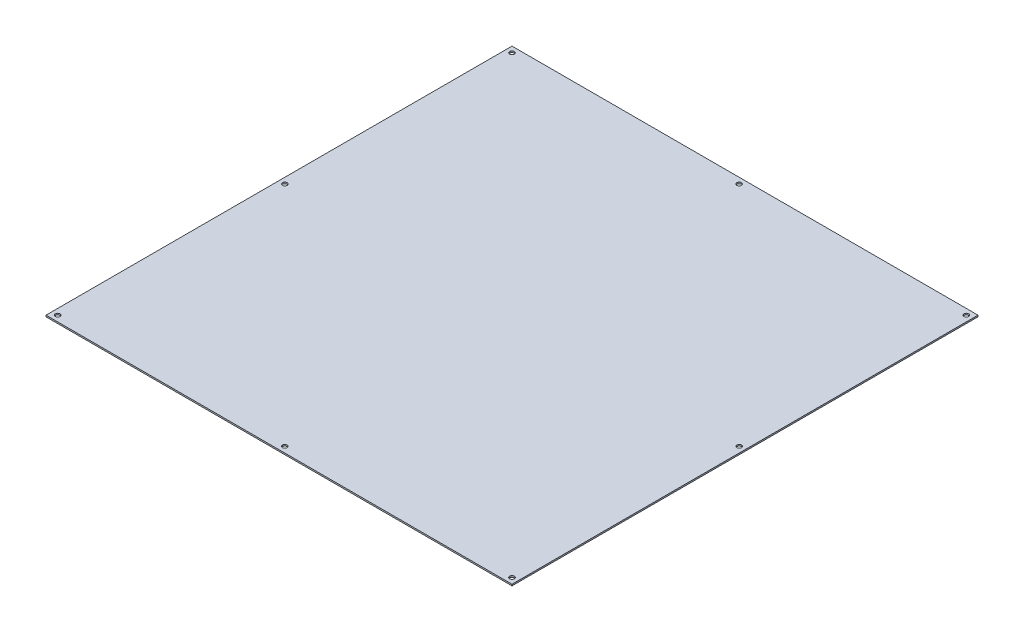
ISO-10303-21;
HEADER;
FILE_DESCRIPTION(('STEP AP214'),'2;1');
FILE_NAME('part.step','',(''),(''),'','','');
FILE_SCHEMA(('AUTOMOTIVE_DESIGN { 1 0 10303 214 1 1 1 1 }'));
ENDSEC;
DATA;
#1=APPLICATION_CONTEXT('core data for automotive mechanical design processes');
#2=APPLICATION_PROTOCOL_DEFINITION('international standard','automotive_design',2000,#1);
#3=PRODUCT_CONTEXT('',#1,'mechanical');
#4=PRODUCT('Part','Part','',(#3));
#5=PRODUCT_RELATED_PRODUCT_CATEGORY('part','',(#4));
#6=PRODUCT_DEFINITION_FORMATION('','',#4);
#7=PRODUCT_DEFINITION_CONTEXT('part definition',#1,'design');
#8=PRODUCT_DEFINITION('design','',#6,#7);
#9=PRODUCT_DEFINITION_SHAPE('','',#8);
#10=(LENGTH_UNIT() NAMED_UNIT(*) SI_UNIT(.MILLI.,.METRE.));
#11=(NAMED_UNIT(*) PLANE_ANGLE_UNIT() SI_UNIT($,.RADIAN.));
#12=(NAMED_UNIT(*) SI_UNIT($,.STERADIAN.) SOLID_ANGLE_UNIT());
#13=UNCERTAINTY_MEASURE_WITH_UNIT(LENGTH_MEASURE(1.E-05),#10,'distance_accuracy_value','');
#14=(GEOMETRIC_REPRESENTATION_CONTEXT(3) GLOBAL_UNCERTAINTY_ASSIGNED_CONTEXT((#13)) GLOBAL_UNIT_ASSIGNED_CONTEXT((#10,
#11,#12)) REPRESENTATION_CONTEXT('',''));
#15=CARTESIAN_POINT('',(0.,0.,0.));
#16=DIRECTION('',(0.,0.,1.));
#17=DIRECTION('',(1.,0.,0.));
#18=AXIS2_PLACEMENT_3D('',#15,#16,#17);
#19=CARTESIAN_POINT('',(160.,1.016,-160.));
#20=DIRECTION('',(-1.,0.,0.));
#21=DIRECTION('',(0.,0.,1.));
#22=AXIS2_PLACEMENT_3D('',#19,#20,#21);
#23=PLANE('',#22);
#24=DIRECTION('',(0.,0.,-1.));
#25=VECTOR('',#24,1.);
#26=CARTESIAN_POINT('',(160.,0.,-160.));
#27=LINE('',#26,#25);
#28=CARTESIAN_POINT('',(160.,0.,160.));
#29=VERTEX_POINT('',#28);
#30=CARTESIAN_POINT('',(160.,0.,-160.));
#31=VERTEX_POINT('',#30);
#32=EDGE_CURVE('E111',#29,#31,#27,.T.);
#33=ORIENTED_EDGE('',*,*,#32,.T.);
#34=DIRECTION('',(0.,-1.,0.));
#35=VECTOR('',#34,1.);
#36=CARTESIAN_POINT('',(160.,1.016,-160.));
#37=LINE('',#36,#35);
#38=CARTESIAN_POINT('',(160.,1.016,-160.));
#39=VERTEX_POINT('',#38);
#40=EDGE_CURVE('E11',#39,#31,#37,.T.);
#41=ORIENTED_EDGE('',*,*,#40,.F.);
#42=DIRECTION('',(0.,0.,-1.));
#43=VECTOR('',#42,1.);
#44=CARTESIAN_POINT('',(160.,1.016,-160.));
#45=LINE('',#44,#43);
#46=CARTESIAN_POINT('',(160.,1.016,160.));
#47=VERTEX_POINT('',#46);
#48=EDGE_CURVE('E95',#47,#39,#45,.T.);
#49=ORIENTED_EDGE('',*,*,#48,.F.);
#50=DIRECTION('',(0.,-1.,0.));
#51=VECTOR('',#50,1.);
#52=CARTESIAN_POINT('',(160.,1.016,160.));
#53=LINE('',#52,#51);
#54=EDGE_CURVE('E107',#47,#29,#53,.T.);
#55=ORIENTED_EDGE('',*,*,#54,.T.);
#56=EDGE_LOOP('',(#33,#41,#49,#55));
#57=FACE_BOUND('',#56,.T.);
#58=ADVANCED_FACE('F43',(#57),#23,.F.);
#59=CARTESIAN_POINT('',(-160.,1.016,-160.));
#60=DIRECTION('',(0.,0.,1.));
#61=DIRECTION('',(1.,0.,0.));
#62=AXIS2_PLACEMENT_3D('',#59,#60,#61);
#63=PLANE('',#62);
#64=DIRECTION('',(-1.,0.,0.));
#65=VECTOR('',#64,1.);
#66=CARTESIAN_POINT('',(-160.,0.,-160.));
#67=LINE('',#66,#65);
#68=CARTESIAN_POINT('',(-160.,0.,-160.));
#69=VERTEX_POINT('',#68);
#70=EDGE_CURVE('E100',#31,#69,#67,.T.);
#71=ORIENTED_EDGE('',*,*,#70,.T.);
#72=DIRECTION('',(0.,-1.,0.));
#73=VECTOR('',#72,1.);
#74=CARTESIAN_POINT('',(-160.,1.016,-160.));
#75=LINE('',#74,#73);
#76=CARTESIAN_POINT('',(-160.,1.016,-160.));
#77=VERTEX_POINT('',#76);
#78=EDGE_CURVE('E52',#77,#69,#75,.T.);
#79=ORIENTED_EDGE('',*,*,#78,.F.);
#80=DIRECTION('',(-1.,0.,0.));
#81=VECTOR('',#80,1.);
#82=CARTESIAN_POINT('',(-160.,1.016,-160.));
#83=LINE('',#82,#81);
#84=EDGE_CURVE('E90',#39,#77,#83,.T.);
#85=ORIENTED_EDGE('',*,*,#84,.F.);
#86=ORIENTED_EDGE('',*,*,#40,.T.);
#87=EDGE_LOOP('',(#71,#79,#85,#86));
#88=FACE_BOUND('',#87,.T.);
#89=ADVANCED_FACE('F99',(#88),#63,.F.);
#90=CARTESIAN_POINT('',(-160.,1.016,-160.));
#91=DIRECTION('',(1.,0.,0.));
#92=DIRECTION('',(0.,0.,-1.));
#93=AXIS2_PLACEMENT_3D('',#90,#91,#92);
#94=PLANE('',#93);
#95=DIRECTION('',(0.,0.,1.));
#96=VECTOR('',#95,1.);
#97=CARTESIAN_POINT('',(-160.,0.,-160.));
#98=LINE('',#97,#96);
#99=CARTESIAN_POINT('',(-160.,0.,160.));
#100=VERTEX_POINT('',#99);
#101=EDGE_CURVE('E77',#69,#100,#98,.T.);
#102=ORIENTED_EDGE('',*,*,#101,.T.);
#103=DIRECTION('',(0.,-1.,0.));
#104=VECTOR('',#103,1.);
#105=CARTESIAN_POINT('',(-160.,1.016,160.));
#106=LINE('',#105,#104);
#107=CARTESIAN_POINT('',(-160.,1.016,160.));
#108=VERTEX_POINT('',#107);
#109=EDGE_CURVE('E102',#108,#100,#106,.T.);
#110=ORIENTED_EDGE('',*,*,#109,.F.);
#111=DIRECTION('',(0.,0.,1.));
#112=VECTOR('',#111,1.);
#113=CARTESIAN_POINT('',(-160.,1.016,-160.));
#114=LINE('',#113,#112);
#115=EDGE_CURVE('E93',#77,#108,#114,.T.);
#116=ORIENTED_EDGE('',*,*,#115,.F.);
#117=ORIENTED_EDGE('',*,*,#78,.T.);
#118=EDGE_LOOP('',(#102,#110,#116,#117));
#119=FACE_BOUND('',#118,.T.);
#120=ADVANCED_FACE('F103',(#119),#94,.F.);
#121=CARTESIAN_POINT('',(-160.,1.016,160.));
#122=DIRECTION('',(0.,0.,-1.));
#123=DIRECTION('',(-1.,0.,0.));
#124=AXIS2_PLACEMENT_3D('',#121,#122,#123);
#125=PLANE('',#124);
#126=DIRECTION('',(1.,0.,0.));
#127=VECTOR('',#126,1.);
#128=CARTESIAN_POINT('',(-160.,0.,160.));
#129=LINE('',#128,#127);
#130=EDGE_CURVE('E83',#100,#29,#129,.T.);
#131=ORIENTED_EDGE('',*,*,#130,.T.);
#132=ORIENTED_EDGE('',*,*,#54,.F.);
#133=DIRECTION('',(1.,0.,0.));
#134=VECTOR('',#133,1.);
#135=CARTESIAN_POINT('',(-160.,1.016,160.));
#136=LINE('',#135,#134);
#137=EDGE_CURVE('E60',#108,#47,#136,.T.);
#138=ORIENTED_EDGE('',*,*,#137,.F.);
#139=ORIENTED_EDGE('',*,*,#109,.T.);
#140=EDGE_LOOP('',(#131,#132,#138,#139));
#141=FACE_BOUND('',#140,.T.);
#142=ADVANCED_FACE('F125',(#141),#125,.F.);
#143=CARTESIAN_POINT('',(0.,1.016,0.));
#144=DIRECTION('',(0.,1.,0.));
#145=DIRECTION('',(0.,0.,1.));
#146=AXIS2_PLACEMENT_3D('',#143,#144,#145);
#147=PLANE('',#146);
#148=CARTESIAN_POINT('',(-155.999999999997,1.016,156.));
#149=DIRECTION('',(0.,1.,0.));
#150=DIRECTION('',(0.,0.,1.));
#151=AXIS2_PLACEMENT_3D('',#148,#149,#150);
#152=CIRCLE('',#151,1.59999999999996);
#153=CARTESIAN_POINT('',(-155.999999999997,1.016,157.6));
#154=VERTEX_POINT('',#153);
#155=EDGE_CURVE('E160',#154,#154,#152,.T.);
#156=ORIENTED_EDGE('',*,*,#155,.F.);
#157=EDGE_LOOP('',(#156));
#158=FACE_BOUND('',#157,.T.);
#159=CARTESIAN_POINT('',(156.000000000002,1.016,0.));
#160=DIRECTION('',(0.,1.,0.));
#161=DIRECTION('',(0.,0.,-1.));
#162=AXIS2_PLACEMENT_3D('',#159,#160,#161);
#163=CIRCLE('',#162,1.59999999999996);
#164=CARTESIAN_POINT('',(156.000000000002,1.016,-1.59999999999996));
#165=VERTEX_POINT('',#164);
#166=EDGE_CURVE('E145',#165,#165,#163,.T.);
#167=ORIENTED_EDGE('',*,*,#166,.F.);
#168=EDGE_LOOP('',(#167));
#169=FACE_BOUND('',#168,.T.);
#170=CARTESIAN_POINT('',(-155.999999999998,1.016,0.));
#171=DIRECTION('',(0.,1.,0.));
#172=DIRECTION('',(0.,0.,1.));
#173=AXIS2_PLACEMENT_3D('',#170,#171,#172);
#174=CIRCLE('',#173,1.59999999999996);
#175=CARTESIAN_POINT('',(-155.999999999998,1.016,1.60000000000002));
#176=VERTEX_POINT('',#175);
#177=EDGE_CURVE('E144',#176,#176,#174,.T.);
#178=ORIENTED_EDGE('',*,*,#177,.F.);
#179=EDGE_LOOP('',(#178));
#180=FACE_BOUND('',#179,.T.);
#181=CARTESIAN_POINT('',(156.,1.016,-156.));
#182=DIRECTION('',(0.,1.,0.));
#183=DIRECTION('',(0.,0.,-1.));
#184=AXIS2_PLACEMENT_3D('',#181,#182,#183);
#185=CIRCLE('',#184,1.59999999999996);
#186=CARTESIAN_POINT('',(156.,1.016,-157.6));
#187=VERTEX_POINT('',#186);
#188=EDGE_CURVE('E136',#187,#187,#185,.T.);
#189=ORIENTED_EDGE('',*,*,#188,.F.);
#190=EDGE_LOOP('',(#189));
#191=FACE_BOUND('',#190,.T.);
#192=CARTESIAN_POINT('',(156.000000000003,1.016,156.));
#193=DIRECTION('',(0.,1.,0.));
#194=DIRECTION('',(0.,0.,-1.));
#195=AXIS2_PLACEMENT_3D('',#192,#193,#194);
#196=CIRCLE('',#195,1.59999999999996);
#197=CARTESIAN_POINT('',(156.000000000003,1.016,154.4));
#198=VERTEX_POINT('',#197);
#199=EDGE_CURVE('E161',#198,#198,#196,.T.);
#200=ORIENTED_EDGE('',*,*,#199,.F.);
#201=EDGE_LOOP('',(#200));
#202=FACE_BOUND('',#201,.T.);
#203=CARTESIAN_POINT('',(3.24892204309047E-12,1.016,156.));
#204=DIRECTION('',(0.,1.,0.));
#205=DIRECTION('',(0.,0.,-1.));
#206=AXIS2_PLACEMENT_3D('',#203,#204,#205);
#207=CIRCLE('',#206,1.59999999999996);
#208=CARTESIAN_POINT('',(3.24892204309047E-12,1.016,154.4));
#209=VERTEX_POINT('',#208);
#210=EDGE_CURVE('E184',#209,#209,#207,.T.);
#211=ORIENTED_EDGE('',*,*,#210,.F.);
#212=EDGE_LOOP('',(#211));
#213=FACE_BOUND('',#212,.T.);
#214=CARTESIAN_POINT('',(0.,1.016,-156.));
#215=DIRECTION('',(0.,1.,0.));
#216=DIRECTION('',(0.,0.,-1.));
#217=AXIS2_PLACEMENT_3D('',#214,#215,#216);
#218=CIRCLE('',#217,1.59999999999996);
#219=CARTESIAN_POINT('',(0.,1.016,-157.6));
#220=VERTEX_POINT('',#219);
#221=EDGE_CURVE('E176',#220,#220,#218,.T.);
#222=ORIENTED_EDGE('',*,*,#221,.F.);
#223=EDGE_LOOP('',(#222));
#224=FACE_BOUND('',#223,.T.);
#225=CARTESIAN_POINT('',(-156.,1.016,-156.));
#226=DIRECTION('',(0.,1.,0.));
#227=DIRECTION('',(0.,0.,1.));
#228=AXIS2_PLACEMENT_3D('',#225,#226,#227);
#229=CIRCLE('',#228,1.59999999999996);
#230=CARTESIAN_POINT('',(-156.,1.016,-154.4));
#231=VERTEX_POINT('',#230);
#232=EDGE_CURVE('E132',#231,#231,#229,.T.);
#233=ORIENTED_EDGE('',*,*,#232,.F.);
#234=EDGE_LOOP('',(#233));
#235=FACE_BOUND('',#234,.T.);
#236=ORIENTED_EDGE('',*,*,#48,.T.);
#237=ORIENTED_EDGE('',*,*,#84,.T.);
#238=ORIENTED_EDGE('',*,*,#115,.T.);
#239=ORIENTED_EDGE('',*,*,#137,.T.);
#240=EDGE_LOOP('',(#236,#237,#238,#239));
#241=FACE_BOUND('',#240,.T.);
#242=ADVANCED_FACE('F91',(#158,#169,#180,#191,#202,#213,#224,#235,#241),#147,.T.);
#243=CARTESIAN_POINT('',(0.,0.,0.));
#244=DIRECTION('',(0.,1.,0.));
#245=DIRECTION('',(0.,0.,1.));
#246=AXIS2_PLACEMENT_3D('',#243,#244,#245);
#247=PLANE('',#246);
#248=CARTESIAN_POINT('',(-155.999999999997,0.,156.));
#249=DIRECTION('',(0.,1.,0.));
#250=DIRECTION('',(0.,0.,1.));
#251=AXIS2_PLACEMENT_3D('',#248,#249,#250);
#252=CIRCLE('',#251,1.59999999999996);
#253=CARTESIAN_POINT('',(-155.999999999997,0.,157.6));
#254=VERTEX_POINT('',#253);
#255=EDGE_CURVE('E156',#254,#254,#252,.T.);
#256=ORIENTED_EDGE('',*,*,#255,.T.);
#257=EDGE_LOOP('',(#256));
#258=FACE_BOUND('',#257,.T.);
#259=CARTESIAN_POINT('',(156.000000000002,0.,0.));
#260=DIRECTION('',(0.,1.,0.));
#261=DIRECTION('',(0.,0.,-1.));
#262=AXIS2_PLACEMENT_3D('',#259,#260,#261);
#263=CIRCLE('',#262,1.59999999999996);
#264=CARTESIAN_POINT('',(156.000000000002,0.,-1.59999999999996));
#265=VERTEX_POINT('',#264);
#266=EDGE_CURVE('E165',#265,#265,#263,.T.);
#267=ORIENTED_EDGE('',*,*,#266,.T.);
#268=EDGE_LOOP('',(#267));
#269=FACE_BOUND('',#268,.T.);
#270=CARTESIAN_POINT('',(-155.999999999998,0.,0.));
#271=DIRECTION('',(0.,1.,0.));
#272=DIRECTION('',(0.,0.,1.));
#273=AXIS2_PLACEMENT_3D('',#270,#271,#272);
#274=CIRCLE('',#273,1.59999999999996);
#275=CARTESIAN_POINT('',(-155.999999999998,0.,1.60000000000002));
#276=VERTEX_POINT('',#275);
#277=EDGE_CURVE('E140',#276,#276,#274,.T.);
#278=ORIENTED_EDGE('',*,*,#277,.T.);
#279=EDGE_LOOP('',(#278));
#280=FACE_BOUND('',#279,.T.);
#281=CARTESIAN_POINT('',(156.,0.,-156.));
#282=DIRECTION('',(0.,1.,0.));
#283=DIRECTION('',(0.,0.,-1.));
#284=AXIS2_PLACEMENT_3D('',#281,#282,#283);
#285=CIRCLE('',#284,1.59999999999996);
#286=CARTESIAN_POINT('',(156.,0.,-157.6));
#287=VERTEX_POINT('',#286);
#288=EDGE_CURVE('E149',#287,#287,#285,.T.);
#289=ORIENTED_EDGE('',*,*,#288,.T.);
#290=EDGE_LOOP('',(#289));
#291=FACE_BOUND('',#290,.T.);
#292=CARTESIAN_POINT('',(156.000000000003,0.,156.));
#293=DIRECTION('',(0.,1.,0.));
#294=DIRECTION('',(0.,0.,-1.));
#295=AXIS2_PLACEMENT_3D('',#292,#293,#294);
#296=CIRCLE('',#295,1.59999999999996);
#297=CARTESIAN_POINT('',(156.000000000003,0.,154.4));
#298=VERTEX_POINT('',#297);
#299=EDGE_CURVE('E188',#298,#298,#296,.T.);
#300=ORIENTED_EDGE('',*,*,#299,.T.);
#301=EDGE_LOOP('',(#300));
#302=FACE_BOUND('',#301,.T.);
#303=CARTESIAN_POINT('',(3.24892204309047E-12,0.,156.));
#304=DIRECTION('',(0.,1.,0.));
#305=DIRECTION('',(0.,0.,-1.));
#306=AXIS2_PLACEMENT_3D('',#303,#304,#305);
#307=CIRCLE('',#306,1.59999999999996);
#308=CARTESIAN_POINT('',(3.24892204309047E-12,0.,154.4));
#309=VERTEX_POINT('',#308);
#310=EDGE_CURVE('E180',#309,#309,#307,.T.);
#311=ORIENTED_EDGE('',*,*,#310,.T.);
#312=EDGE_LOOP('',(#311));
#313=FACE_BOUND('',#312,.T.);
#314=CARTESIAN_POINT('',(0.,0.,-156.));
#315=DIRECTION('',(0.,1.,0.));
#316=DIRECTION('',(0.,0.,-1.));
#317=AXIS2_PLACEMENT_3D('',#314,#315,#316);
#318=CIRCLE('',#317,1.59999999999996);
#319=CARTESIAN_POINT('',(0.,0.,-157.6));
#320=VERTEX_POINT('',#319);
#321=EDGE_CURVE('E172',#320,#320,#318,.T.);
#322=ORIENTED_EDGE('',*,*,#321,.T.);
#323=EDGE_LOOP('',(#322));
#324=FACE_BOUND('',#323,.T.);
#325=CARTESIAN_POINT('',(-156.,0.,-156.));
#326=DIRECTION('',(0.,1.,0.));
#327=DIRECTION('',(0.,0.,1.));
#328=AXIS2_PLACEMENT_3D('',#325,#326,#327);
#329=CIRCLE('',#328,1.59999999999996);
#330=CARTESIAN_POINT('',(-156.,0.,-154.4));
#331=VERTEX_POINT('',#330);
#332=EDGE_CURVE('E115',#331,#331,#329,.T.);
#333=ORIENTED_EDGE('',*,*,#332,.T.);
#334=EDGE_LOOP('',(#333));
#335=FACE_BOUND('',#334,.T.);
#336=ORIENTED_EDGE('',*,*,#32,.F.);
#337=ORIENTED_EDGE('',*,*,#130,.F.);
#338=ORIENTED_EDGE('',*,*,#101,.F.);
#339=ORIENTED_EDGE('',*,*,#70,.F.);
#340=EDGE_LOOP('',(#336,#337,#338,#339));
#341=FACE_BOUND('',#340,.T.);
#342=ADVANCED_FACE('F128',(#258,#269,#280,#291,#302,#313,#324,#335,#341),#247,.F.);
#343=CARTESIAN_POINT('',(-156.,0.,-156.));
#344=DIRECTION('',(0.,1.,0.));
#345=DIRECTION('',(0.,0.,1.));
#346=AXIS2_PLACEMENT_3D('',#343,#344,#345);
#347=CYLINDRICAL_SURFACE('',#346,1.59999999999996);
#348=ORIENTED_EDGE('',*,*,#332,.F.);
#349=EDGE_LOOP('',(#348));
#350=FACE_BOUND('',#349,.T.);
#351=ORIENTED_EDGE('',*,*,#232,.T.);
#352=EDGE_LOOP('',(#351));
#353=FACE_BOUND('',#352,.T.);
#354=ADVANCED_FACE('F208',(#350,#353),#347,.F.);
#355=CARTESIAN_POINT('',(0.,0.,-156.));
#356=DIRECTION('',(0.,1.,0.));
#357=DIRECTION('',(0.,0.,1.));
#358=AXIS2_PLACEMENT_3D('',#355,#356,#357);
#359=CYLINDRICAL_SURFACE('',#358,1.59999999999996);
#360=ORIENTED_EDGE('',*,*,#321,.F.);
#361=EDGE_LOOP('',(#360));
#362=FACE_BOUND('',#361,.T.);
#363=ORIENTED_EDGE('',*,*,#221,.T.);
#364=EDGE_LOOP('',(#363));
#365=FACE_BOUND('',#364,.T.);
#366=ADVANCED_FACE('F210',(#362,#365),#359,.F.);
#367=CARTESIAN_POINT('',(3.24892204309047E-12,0.,156.));
#368=DIRECTION('',(0.,1.,0.));
#369=DIRECTION('',(0.,0.,1.));
#370=AXIS2_PLACEMENT_3D('',#367,#368,#369);
#371=CYLINDRICAL_SURFACE('',#370,1.59999999999996);
#372=ORIENTED_EDGE('',*,*,#310,.F.);
#373=EDGE_LOOP('',(#372));
#374=FACE_BOUND('',#373,.T.);
#375=ORIENTED_EDGE('',*,*,#210,.T.);
#376=EDGE_LOOP('',(#375));
#377=FACE_BOUND('',#376,.T.);
#378=ADVANCED_FACE('F217',(#374,#377),#371,.F.);
#379=CARTESIAN_POINT('',(156.000000000003,0.,156.));
#380=DIRECTION('',(0.,1.,0.));
#381=DIRECTION('',(0.,0.,1.));
#382=AXIS2_PLACEMENT_3D('',#379,#380,#381);
#383=CYLINDRICAL_SURFACE('',#382,1.59999999999996);
#384=ORIENTED_EDGE('',*,*,#299,.F.);
#385=EDGE_LOOP('',(#384));
#386=FACE_BOUND('',#385,.T.);
#387=ORIENTED_EDGE('',*,*,#199,.T.);
#388=EDGE_LOOP('',(#387));
#389=FACE_BOUND('',#388,.T.);
#390=ADVANCED_FACE('F196',(#386,#389),#383,.F.);
#391=CARTESIAN_POINT('',(156.,0.,-156.));
#392=DIRECTION('',(0.,1.,0.));
#393=DIRECTION('',(0.,0.,1.));
#394=AXIS2_PLACEMENT_3D('',#391,#392,#393);
#395=CYLINDRICAL_SURFACE('',#394,1.59999999999996);
#396=ORIENTED_EDGE('',*,*,#288,.F.);
#397=EDGE_LOOP('',(#396));
#398=FACE_BOUND('',#397,.T.);
#399=ORIENTED_EDGE('',*,*,#188,.T.);
#400=EDGE_LOOP('',(#399));
#401=FACE_BOUND('',#400,.T.);
#402=ADVANCED_FACE('F278',(#398,#401),#395,.F.);
#403=CARTESIAN_POINT('',(-155.999999999998,0.,0.));
#404=DIRECTION('',(0.,1.,0.));
#405=DIRECTION('',(0.,0.,1.));
#406=AXIS2_PLACEMENT_3D('',#403,#404,#405);
#407=CYLINDRICAL_SURFACE('',#406,1.59999999999996);
#408=ORIENTED_EDGE('',*,*,#277,.F.);
#409=EDGE_LOOP('',(#408));
#410=FACE_BOUND('',#409,.T.);
#411=ORIENTED_EDGE('',*,*,#177,.T.);
#412=EDGE_LOOP('',(#411));
#413=FACE_BOUND('',#412,.T.);
#414=ADVANCED_FACE('F289',(#410,#413),#407,.F.);
#415=CARTESIAN_POINT('',(156.000000000002,0.,0.));
#416=DIRECTION('',(0.,1.,0.));
#417=DIRECTION('',(0.,0.,1.));
#418=AXIS2_PLACEMENT_3D('',#415,#416,#417);
#419=CYLINDRICAL_SURFACE('',#418,1.59999999999996);
#420=ORIENTED_EDGE('',*,*,#266,.F.);
#421=EDGE_LOOP('',(#420));
#422=FACE_BOUND('',#421,.T.);
#423=ORIENTED_EDGE('',*,*,#166,.T.);
#424=EDGE_LOOP('',(#423));
#425=FACE_BOUND('',#424,.T.);
#426=ADVANCED_FACE('F300',(#422,#425),#419,.F.);
#427=CARTESIAN_POINT('',(-155.999999999997,0.,156.));
#428=DIRECTION('',(0.,1.,0.));
#429=DIRECTION('',(0.,0.,1.));
#430=AXIS2_PLACEMENT_3D('',#427,#428,#429);
#431=CYLINDRICAL_SURFACE('',#430,1.59999999999996);
#432=ORIENTED_EDGE('',*,*,#255,.F.);
#433=EDGE_LOOP('',(#432));
#434=FACE_BOUND('',#433,.T.);
#435=ORIENTED_EDGE('',*,*,#155,.T.);
#436=EDGE_LOOP('',(#435));
#437=FACE_BOUND('',#436,.T.);
#438=ADVANCED_FACE('F310',(#434,#437),#431,.F.);
#439=CLOSED_SHELL('',(#58,#89,#120,#142,#242,#342,#354,#366,#378,#390,#402,#414,#426,#438));
#440=MANIFOLD_SOLID_BREP('B2',#439);
#441=ADVANCED_BREP_SHAPE_REPRESENTATION('',(#18,#440),#14);
#442=SHAPE_DEFINITION_REPRESENTATION(#9,#441);
ENDSEC;
END-ISO-10303-21;
